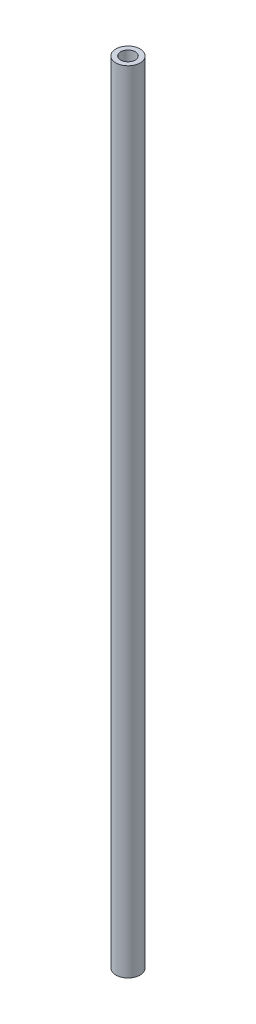
ISO-10303-21;
HEADER;
FILE_DESCRIPTION(('STEP AP214'),'2;1');
FILE_NAME('part.step','',(''),(''),'','','');
FILE_SCHEMA(('AUTOMOTIVE_DESIGN { 1 0 10303 214 1 1 1 1 }'));
ENDSEC;
DATA;
#1=APPLICATION_CONTEXT('core data for automotive mechanical design processes');
#2=APPLICATION_PROTOCOL_DEFINITION('international standard','automotive_design',2000,#1);
#3=PRODUCT_CONTEXT('',#1,'mechanical');
#4=PRODUCT('Part','Part','',(#3));
#5=PRODUCT_RELATED_PRODUCT_CATEGORY('part','',(#4));
#6=PRODUCT_DEFINITION_FORMATION('','',#4);
#7=PRODUCT_DEFINITION_CONTEXT('part definition',#1,'design');
#8=PRODUCT_DEFINITION('design','',#6,#7);
#9=PRODUCT_DEFINITION_SHAPE('','',#8);
#10=(LENGTH_UNIT() NAMED_UNIT(*) SI_UNIT(.MILLI.,.METRE.));
#11=(NAMED_UNIT(*) PLANE_ANGLE_UNIT() SI_UNIT($,.RADIAN.));
#12=(NAMED_UNIT(*) SI_UNIT($,.STERADIAN.) SOLID_ANGLE_UNIT());
#13=UNCERTAINTY_MEASURE_WITH_UNIT(LENGTH_MEASURE(1.E-05),#10,'distance_accuracy_value','');
#14=(GEOMETRIC_REPRESENTATION_CONTEXT(3) GLOBAL_UNCERTAINTY_ASSIGNED_CONTEXT((#13)) GLOBAL_UNIT_ASSIGNED_CONTEXT((#10,
#11,#12)) REPRESENTATION_CONTEXT('',''));
#15=CARTESIAN_POINT('',(0.,0.,0.));
#16=DIRECTION('',(0.,0.,1.));
#17=DIRECTION('',(1.,0.,0.));
#18=AXIS2_PLACEMENT_3D('',#15,#16,#17);
#19=CARTESIAN_POINT('',(0.,81.5,0.));
#20=DIRECTION('',(0.,1.,0.));
#21=DIRECTION('',(0.,0.,1.));
#22=AXIS2_PLACEMENT_3D('',#19,#20,#21);
#23=PLANE('',#22);
#24=CARTESIAN_POINT('',(0.,81.5,0.));
#25=DIRECTION('',(0.,1.,0.));
#26=DIRECTION('',(0.,0.,1.));
#27=AXIS2_PLACEMENT_3D('',#24,#25,#26);
#28=CIRCLE('',#27,2.5);
#29=CARTESIAN_POINT('',(0.,81.5,2.5));
#30=VERTEX_POINT('',#29);
#31=EDGE_CURVE('E11',#30,#30,#28,.T.);
#32=ORIENTED_EDGE('',*,*,#31,.T.);
#33=EDGE_LOOP('',(#32));
#34=FACE_BOUND('',#33,.T.);
#35=CARTESIAN_POINT('',(0.,81.5,0.));
#36=DIRECTION('',(0.,1.,0.));
#37=DIRECTION('',(0.,0.,1.));
#38=AXIS2_PLACEMENT_3D('',#35,#36,#37);
#39=CIRCLE('',#38,1.5);
#40=CARTESIAN_POINT('',(0.,81.5,1.5));
#41=VERTEX_POINT('',#40);
#42=EDGE_CURVE('E58',#41,#41,#39,.T.);
#43=ORIENTED_EDGE('',*,*,#42,.F.);
#44=EDGE_LOOP('',(#43));
#45=FACE_BOUND('',#44,.T.);
#46=ADVANCED_FACE('F45',(#34,#45),#23,.T.);
#47=CARTESIAN_POINT('',(0.,-81.5,0.));
#48=DIRECTION('',(0.,1.,0.));
#49=DIRECTION('',(0.,0.,1.));
#50=AXIS2_PLACEMENT_3D('',#47,#48,#49);
#51=PLANE('',#50);
#52=CARTESIAN_POINT('',(0.,-81.5,0.));
#53=DIRECTION('',(0.,1.,0.));
#54=DIRECTION('',(0.,0.,1.));
#55=AXIS2_PLACEMENT_3D('',#52,#53,#54);
#56=CIRCLE('',#55,2.5);
#57=CARTESIAN_POINT('',(0.,-81.5,2.5));
#58=VERTEX_POINT('',#57);
#59=EDGE_CURVE('E49',#58,#58,#56,.T.);
#60=ORIENTED_EDGE('',*,*,#59,.F.);
#61=EDGE_LOOP('',(#60));
#62=FACE_BOUND('',#61,.T.);
#63=CARTESIAN_POINT('',(0.,-81.5,0.));
#64=DIRECTION('',(0.,1.,0.));
#65=DIRECTION('',(0.,0.,1.));
#66=AXIS2_PLACEMENT_3D('',#63,#64,#65);
#67=CIRCLE('',#66,1.5);
#68=CARTESIAN_POINT('',(0.,-81.5,1.5));
#69=VERTEX_POINT('',#68);
#70=EDGE_CURVE('E60',#69,#69,#67,.T.);
#71=ORIENTED_EDGE('',*,*,#70,.T.);
#72=EDGE_LOOP('',(#71));
#73=FACE_BOUND('',#72,.T.);
#74=ADVANCED_FACE('F72',(#62,#73),#51,.F.);
#75=CARTESIAN_POINT('',(0.,81.5,0.));
#76=DIRECTION('',(0.,-1.,0.));
#77=DIRECTION('',(0.,0.,-1.));
#78=AXIS2_PLACEMENT_3D('',#75,#76,#77);
#79=CYLINDRICAL_SURFACE('',#78,2.5);
#80=ORIENTED_EDGE('',*,*,#31,.F.);
#81=EDGE_LOOP('',(#80));
#82=FACE_BOUND('',#81,.T.);
#83=ORIENTED_EDGE('',*,*,#59,.T.);
#84=EDGE_LOOP('',(#83));
#85=FACE_BOUND('',#84,.T.);
#86=ADVANCED_FACE('F47',(#82,#85),#79,.T.);
#87=CARTESIAN_POINT('',(0.,81.5,0.));
#88=DIRECTION('',(0.,-1.,0.));
#89=DIRECTION('',(0.,0.,-1.));
#90=AXIS2_PLACEMENT_3D('',#87,#88,#89);
#91=CYLINDRICAL_SURFACE('',#90,1.5);
#92=ORIENTED_EDGE('',*,*,#42,.T.);
#93=EDGE_LOOP('',(#92));
#94=FACE_BOUND('',#93,.T.);
#95=ORIENTED_EDGE('',*,*,#70,.F.);
#96=EDGE_LOOP('',(#95));
#97=FACE_BOUND('',#96,.T.);
#98=ADVANCED_FACE('F68',(#94,#97),#91,.F.);
#99=CLOSED_SHELL('',(#46,#74,#86,#98));
#100=MANIFOLD_SOLID_BREP('B2',#99);
#101=ADVANCED_BREP_SHAPE_REPRESENTATION('',(#18,#100),#14);
#102=SHAPE_DEFINITION_REPRESENTATION(#9,#101);
ENDSEC;
END-ISO-10303-21;
